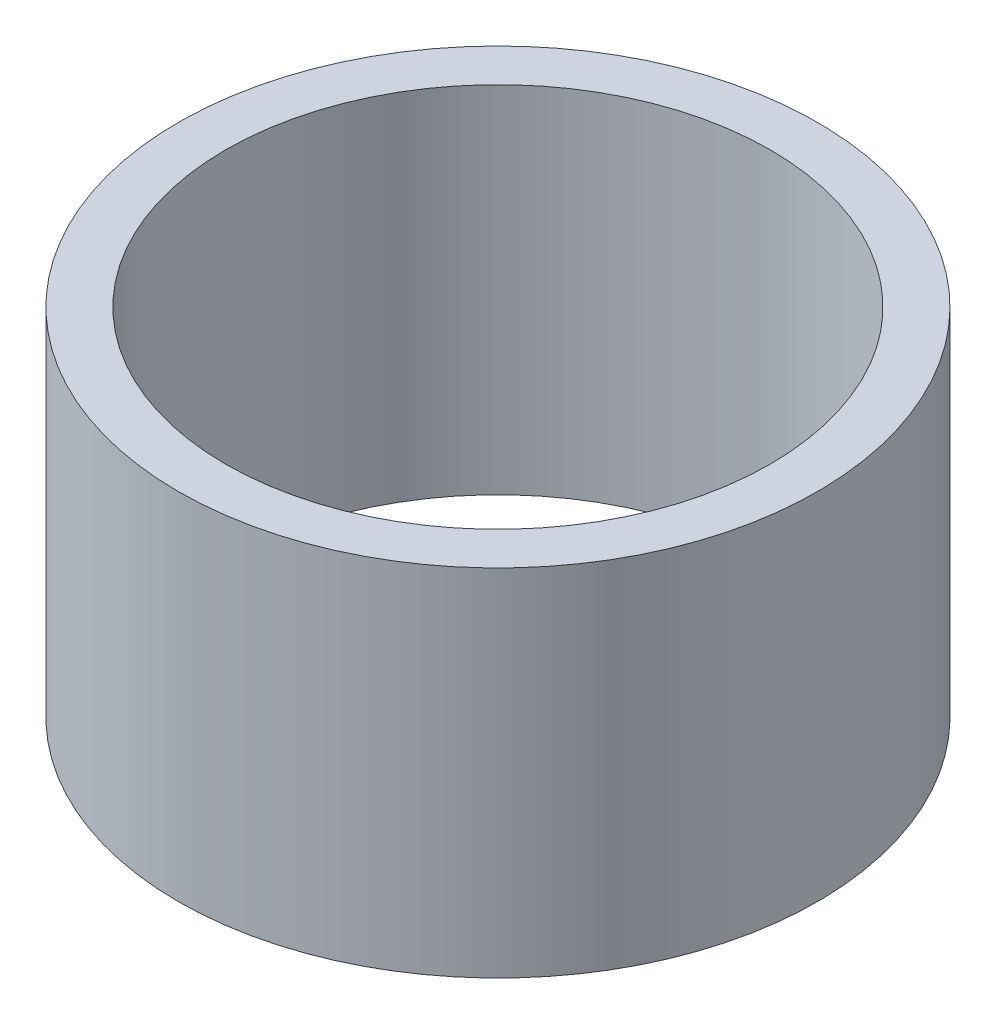
ISO-10303-21;
HEADER;
FILE_DESCRIPTION(('STEP AP214'),'2;1');
FILE_NAME('part.step','',(''),(''),'','','');
FILE_SCHEMA(('AUTOMOTIVE_DESIGN { 1 0 10303 214 1 1 1 1 }'));
ENDSEC;
DATA;
#1=APPLICATION_CONTEXT('core data for automotive mechanical design processes');
#2=APPLICATION_PROTOCOL_DEFINITION('international standard','automotive_design',2000,#1);
#3=PRODUCT_CONTEXT('',#1,'mechanical');
#4=PRODUCT('Part','Part','',(#3));
#5=PRODUCT_RELATED_PRODUCT_CATEGORY('part','',(#4));
#6=PRODUCT_DEFINITION_FORMATION('','',#4);
#7=PRODUCT_DEFINITION_CONTEXT('part definition',#1,'design');
#8=PRODUCT_DEFINITION('design','',#6,#7);
#9=PRODUCT_DEFINITION_SHAPE('','',#8);
#10=(LENGTH_UNIT() NAMED_UNIT(*) SI_UNIT(.MILLI.,.METRE.));
#11=(NAMED_UNIT(*) PLANE_ANGLE_UNIT() SI_UNIT($,.RADIAN.));
#12=(NAMED_UNIT(*) SI_UNIT($,.STERADIAN.) SOLID_ANGLE_UNIT());
#13=UNCERTAINTY_MEASURE_WITH_UNIT(LENGTH_MEASURE(1.E-05),#10,'distance_accuracy_value','');
#14=(GEOMETRIC_REPRESENTATION_CONTEXT(3) GLOBAL_UNCERTAINTY_ASSIGNED_CONTEXT((#13)) GLOBAL_UNIT_ASSIGNED_CONTEXT((#10,
#11,#12)) REPRESENTATION_CONTEXT('',''));
#15=CARTESIAN_POINT('',(0.,0.,0.));
#16=DIRECTION('',(0.,0.,1.));
#17=DIRECTION('',(1.,0.,0.));
#18=AXIS2_PLACEMENT_3D('',#15,#16,#17);
#19=CARTESIAN_POINT('',(0.,1.5,0.));
#20=DIRECTION('',(0.,-1.,0.));
#21=DIRECTION('',(0.,0.,-1.));
#22=AXIS2_PLACEMENT_3D('',#19,#20,#21);
#23=CYLINDRICAL_SURFACE('',#22,1.35);
#24=CARTESIAN_POINT('',(0.,1.5,0.));
#25=DIRECTION('',(0.,1.,0.));
#26=DIRECTION('',(0.,0.,1.));
#27=AXIS2_PLACEMENT_3D('',#24,#25,#26);
#28=CIRCLE('',#27,1.35);
#29=CARTESIAN_POINT('',(0.,1.5,1.35));
#30=VERTEX_POINT('',#29);
#31=EDGE_CURVE('E10',#30,#30,#28,.T.);
#32=ORIENTED_EDGE('',*,*,#31,.F.);
#33=EDGE_LOOP('',(#32));
#34=FACE_BOUND('',#33,.T.);
#35=CARTESIAN_POINT('',(0.,0.,0.));
#36=DIRECTION('',(0.,1.,0.));
#37=DIRECTION('',(0.,0.,1.));
#38=AXIS2_PLACEMENT_3D('',#35,#36,#37);
#39=CIRCLE('',#38,1.35);
#40=CARTESIAN_POINT('',(0.,0.,1.35));
#41=VERTEX_POINT('',#40);
#42=EDGE_CURVE('E38',#41,#41,#39,.T.);
#43=ORIENTED_EDGE('',*,*,#42,.T.);
#44=EDGE_LOOP('',(#43));
#45=FACE_BOUND('',#44,.T.);
#46=ADVANCED_FACE('F35',(#34,#45),#23,.T.);
#47=CARTESIAN_POINT('',(0.,1.5,0.));
#48=DIRECTION('',(0.,1.,0.));
#49=DIRECTION('',(0.,0.,1.));
#50=AXIS2_PLACEMENT_3D('',#47,#48,#49);
#51=PLANE('',#50);
#52=CARTESIAN_POINT('',(0.,1.5,0.));
#53=DIRECTION('',(0.,1.,0.));
#54=DIRECTION('',(0.,0.,1.));
#55=AXIS2_PLACEMENT_3D('',#52,#53,#54);
#56=CIRCLE('',#55,1.15);
#57=CARTESIAN_POINT('',(0.,1.5,1.15));
#58=VERTEX_POINT('',#57);
#59=EDGE_CURVE('E47',#58,#58,#56,.T.);
#60=ORIENTED_EDGE('',*,*,#59,.F.);
#61=EDGE_LOOP('',(#60));
#62=FACE_BOUND('',#61,.T.);
#63=ORIENTED_EDGE('',*,*,#31,.T.);
#64=EDGE_LOOP('',(#63));
#65=FACE_BOUND('',#64,.T.);
#66=ADVANCED_FACE('F62',(#62,#65),#51,.T.);
#67=CARTESIAN_POINT('',(0.,0.,0.));
#68=DIRECTION('',(0.,1.,0.));
#69=DIRECTION('',(0.,0.,1.));
#70=AXIS2_PLACEMENT_3D('',#67,#68,#69);
#71=PLANE('',#70);
#72=CARTESIAN_POINT('',(0.,0.,0.));
#73=DIRECTION('',(0.,1.,0.));
#74=DIRECTION('',(0.,0.,1.));
#75=AXIS2_PLACEMENT_3D('',#72,#73,#74);
#76=CIRCLE('',#75,1.15);
#77=CARTESIAN_POINT('',(0.,0.,1.15));
#78=VERTEX_POINT('',#77);
#79=EDGE_CURVE('E45',#78,#78,#76,.T.);
#80=ORIENTED_EDGE('',*,*,#79,.T.);
#81=EDGE_LOOP('',(#80));
#82=FACE_BOUND('',#81,.T.);
#83=ORIENTED_EDGE('',*,*,#42,.F.);
#84=EDGE_LOOP('',(#83));
#85=FACE_BOUND('',#84,.T.);
#86=ADVANCED_FACE('F53',(#82,#85),#71,.F.);
#87=CARTESIAN_POINT('',(0.,0.,0.));
#88=DIRECTION('',(0.,1.,0.));
#89=DIRECTION('',(0.,0.,1.));
#90=AXIS2_PLACEMENT_3D('',#87,#88,#89);
#91=CYLINDRICAL_SURFACE('',#90,1.15);
#92=ORIENTED_EDGE('',*,*,#79,.F.);
#93=EDGE_LOOP('',(#92));
#94=FACE_BOUND('',#93,.T.);
#95=ORIENTED_EDGE('',*,*,#59,.T.);
#96=EDGE_LOOP('',(#95));
#97=FACE_BOUND('',#96,.T.);
#98=ADVANCED_FACE('F56',(#94,#97),#91,.F.);
#99=CLOSED_SHELL('',(#46,#66,#86,#98));
#100=MANIFOLD_SOLID_BREP('B2',#99);
#101=ADVANCED_BREP_SHAPE_REPRESENTATION('',(#18,#100),#14);
#102=SHAPE_DEFINITION_REPRESENTATION(#9,#101);
ENDSEC;
END-ISO-10303-21;
